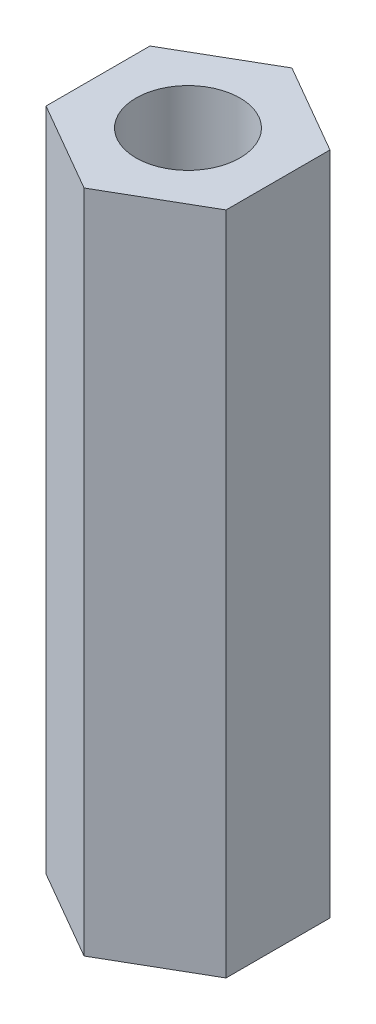
ISO-10303-21;
HEADER;
FILE_DESCRIPTION(('STEP AP214'),'2;1');
FILE_NAME('part.step','',(''),(''),'','','');
FILE_SCHEMA(('AUTOMOTIVE_DESIGN { 1 0 10303 214 1 1 1 1 }'));
ENDSEC;
DATA;
#1=APPLICATION_CONTEXT('core data for automotive mechanical design processes');
#2=APPLICATION_PROTOCOL_DEFINITION('international standard','automotive_design',2000,#1);
#3=PRODUCT_CONTEXT('',#1,'mechanical');
#4=PRODUCT('Part','Part','',(#3));
#5=PRODUCT_RELATED_PRODUCT_CATEGORY('part','',(#4));
#6=PRODUCT_DEFINITION_FORMATION('','',#4);
#7=PRODUCT_DEFINITION_CONTEXT('part definition',#1,'design');
#8=PRODUCT_DEFINITION('design','',#6,#7);
#9=PRODUCT_DEFINITION_SHAPE('','',#8);
#10=(LENGTH_UNIT() NAMED_UNIT(*) SI_UNIT(.MILLI.,.METRE.));
#11=(NAMED_UNIT(*) PLANE_ANGLE_UNIT() SI_UNIT($,.RADIAN.));
#12=(NAMED_UNIT(*) SI_UNIT($,.STERADIAN.) SOLID_ANGLE_UNIT());
#13=UNCERTAINTY_MEASURE_WITH_UNIT(LENGTH_MEASURE(1.E-05),#10,'distance_accuracy_value','');
#14=(GEOMETRIC_REPRESENTATION_CONTEXT(3) GLOBAL_UNCERTAINTY_ASSIGNED_CONTEXT((#13)) GLOBAL_UNIT_ASSIGNED_CONTEXT((#10,
#11,#12)) REPRESENTATION_CONTEXT('',''));
#15=CARTESIAN_POINT('',(0.,0.,0.));
#16=DIRECTION('',(0.,0.,1.));
#17=DIRECTION('',(1.,0.,0.));
#18=AXIS2_PLACEMENT_3D('',#15,#16,#17);
#19=CARTESIAN_POINT('',(0.,32.,-5.));
#20=DIRECTION('',(0.,1.,0.));
#21=DIRECTION('',(0.,0.,1.));
#22=AXIS2_PLACEMENT_3D('',#19,#20,#21);
#23=PLANE('',#22);
#24=DIRECTION('',(-0.866025403784439,0.,-0.5));
#25=VECTOR('',#24,1.);
#26=CARTESIAN_POINT('',(4.33012701892219,32.,-2.5));
#27=LINE('',#26,#25);
#28=CARTESIAN_POINT('',(4.33012701892219,32.,-2.5));
#29=VERTEX_POINT('',#28);
#30=CARTESIAN_POINT('',(0.,32.,-5.));
#31=VERTEX_POINT('',#30);
#32=EDGE_CURVE('E127',#29,#31,#27,.T.);
#33=ORIENTED_EDGE('',*,*,#32,.T.);
#34=DIRECTION('',(-0.866025403784439,0.,0.5));
#35=VECTOR('',#34,1.);
#36=CARTESIAN_POINT('',(0.,32.,-5.));
#37=LINE('',#36,#35);
#38=CARTESIAN_POINT('',(-4.33012701892219,32.,-2.5));
#39=VERTEX_POINT('',#38);
#40=EDGE_CURVE('E85',#31,#39,#37,.T.);
#41=ORIENTED_EDGE('',*,*,#40,.T.);
#42=DIRECTION('',(0.,0.,1.));
#43=VECTOR('',#42,1.);
#44=CARTESIAN_POINT('',(-4.33012701892219,32.,-2.5));
#45=LINE('',#44,#43);
#46=CARTESIAN_POINT('',(-4.33012701892219,32.,2.5));
#47=VERTEX_POINT('',#46);
#48=EDGE_CURVE('E98',#39,#47,#45,.T.);
#49=ORIENTED_EDGE('',*,*,#48,.T.);
#50=DIRECTION('',(0.866025403784439,0.,0.5));
#51=VECTOR('',#50,1.);
#52=CARTESIAN_POINT('',(-4.33012701892219,32.,2.5));
#53=LINE('',#52,#51);
#54=CARTESIAN_POINT('',(0.,32.,5.));
#55=VERTEX_POINT('',#54);
#56=EDGE_CURVE('E92',#47,#55,#53,.T.);
#57=ORIENTED_EDGE('',*,*,#56,.T.);
#58=DIRECTION('',(0.866025403784439,0.,-0.5));
#59=VECTOR('',#58,1.);
#60=CARTESIAN_POINT('',(0.,32.,5.));
#61=LINE('',#60,#59);
#62=CARTESIAN_POINT('',(4.33012701892219,32.,2.5));
#63=VERTEX_POINT('',#62);
#64=EDGE_CURVE('E96',#55,#63,#61,.T.);
#65=ORIENTED_EDGE('',*,*,#64,.T.);
#66=DIRECTION('',(0.,0.,-1.));
#67=VECTOR('',#66,1.);
#68=CARTESIAN_POINT('',(4.33012701892219,32.,2.5));
#69=LINE('',#68,#67);
#70=EDGE_CURVE('E48',#63,#29,#69,.T.);
#71=ORIENTED_EDGE('',*,*,#70,.T.);
#72=EDGE_LOOP('',(#33,#41,#49,#57,#65,#71));
#73=FACE_BOUND('',#72,.T.);
#74=CARTESIAN_POINT('',(0.,32.,0.));
#75=DIRECTION('',(0.,1.,0.));
#76=DIRECTION('',(0.,0.,1.));
#77=AXIS2_PLACEMENT_3D('',#74,#75,#76);
#78=CIRCLE('',#77,2.5);
#79=CARTESIAN_POINT('',(0.,32.,2.5));
#80=VERTEX_POINT('',#79);
#81=EDGE_CURVE('E120',#80,#80,#78,.T.);
#82=ORIENTED_EDGE('',*,*,#81,.F.);
#83=EDGE_LOOP('',(#82));
#84=FACE_BOUND('',#83,.T.);
#85=ADVANCED_FACE('F31',(#73,#84),#23,.T.);
#86=CARTESIAN_POINT('',(0.,0.,-5.));
#87=DIRECTION('',(0.,1.,0.));
#88=DIRECTION('',(0.,0.,1.));
#89=AXIS2_PLACEMENT_3D('',#86,#87,#88);
#90=PLANE('',#89);
#91=DIRECTION('',(-0.866025403784439,0.,-0.5));
#92=VECTOR('',#91,1.);
#93=CARTESIAN_POINT('',(4.33012701892219,0.,-2.5));
#94=LINE('',#93,#92);
#95=CARTESIAN_POINT('',(4.33012701892219,0.,-2.5));
#96=VERTEX_POINT('',#95);
#97=CARTESIAN_POINT('',(0.,0.,-5.));
#98=VERTEX_POINT('',#97);
#99=EDGE_CURVE('E116',#96,#98,#94,.T.);
#100=ORIENTED_EDGE('',*,*,#99,.F.);
#101=DIRECTION('',(0.,0.,-1.));
#102=VECTOR('',#101,1.);
#103=CARTESIAN_POINT('',(4.33012701892219,0.,2.5));
#104=LINE('',#103,#102);
#105=CARTESIAN_POINT('',(4.33012701892219,0.,2.5));
#106=VERTEX_POINT('',#105);
#107=EDGE_CURVE('E77',#106,#96,#104,.T.);
#108=ORIENTED_EDGE('',*,*,#107,.F.);
#109=DIRECTION('',(0.866025403784439,0.,-0.5));
#110=VECTOR('',#109,1.);
#111=CARTESIAN_POINT('',(0.,0.,5.));
#112=LINE('',#111,#110);
#113=CARTESIAN_POINT('',(0.,0.,5.));
#114=VERTEX_POINT('',#113);
#115=EDGE_CURVE('E71',#114,#106,#112,.T.);
#116=ORIENTED_EDGE('',*,*,#115,.F.);
#117=DIRECTION('',(0.866025403784439,0.,0.5));
#118=VECTOR('',#117,1.);
#119=CARTESIAN_POINT('',(-4.33012701892219,0.,2.5));
#120=LINE('',#119,#118);
#121=CARTESIAN_POINT('',(-4.33012701892219,0.,2.5));
#122=VERTEX_POINT('',#121);
#123=EDGE_CURVE('E106',#122,#114,#120,.T.);
#124=ORIENTED_EDGE('',*,*,#123,.F.);
#125=DIRECTION('',(0.,0.,1.));
#126=VECTOR('',#125,1.);
#127=CARTESIAN_POINT('',(-4.33012701892219,0.,-2.5));
#128=LINE('',#127,#126);
#129=CARTESIAN_POINT('',(-4.33012701892219,0.,-2.5));
#130=VERTEX_POINT('',#129);
#131=EDGE_CURVE('E122',#130,#122,#128,.T.);
#132=ORIENTED_EDGE('',*,*,#131,.F.);
#133=DIRECTION('',(-0.866025403784439,0.,0.5));
#134=VECTOR('',#133,1.);
#135=CARTESIAN_POINT('',(0.,0.,-5.));
#136=LINE('',#135,#134);
#137=EDGE_CURVE('E119',#98,#130,#136,.T.);
#138=ORIENTED_EDGE('',*,*,#137,.F.);
#139=EDGE_LOOP('',(#100,#108,#116,#124,#132,#138));
#140=FACE_BOUND('',#139,.T.);
#141=CARTESIAN_POINT('',(0.,0.,0.));
#142=DIRECTION('',(0.,1.,0.));
#143=DIRECTION('',(0.,0.,1.));
#144=AXIS2_PLACEMENT_3D('',#141,#142,#143);
#145=CIRCLE('',#144,2.5);
#146=CARTESIAN_POINT('',(0.,0.,2.5));
#147=VERTEX_POINT('',#146);
#148=EDGE_CURVE('E220',#147,#147,#145,.T.);
#149=ORIENTED_EDGE('',*,*,#148,.T.);
#150=EDGE_LOOP('',(#149));
#151=FACE_BOUND('',#150,.T.);
#152=ADVANCED_FACE('F136',(#140,#151),#90,.F.);
#153=CARTESIAN_POINT('',(4.33012701892219,32.,-2.5));
#154=DIRECTION('',(-0.5,0.,0.866025403784439));
#155=DIRECTION('',(0.866025403784439,0.,0.5));
#156=AXIS2_PLACEMENT_3D('',#153,#154,#155);
#157=PLANE('',#156);
#158=ORIENTED_EDGE('',*,*,#99,.T.);
#159=DIRECTION('',(0.,-1.,0.));
#160=VECTOR('',#159,1.);
#161=CARTESIAN_POINT('',(0.,32.,-5.));
#162=LINE('',#161,#160);
#163=EDGE_CURVE('E11',#31,#98,#162,.T.);
#164=ORIENTED_EDGE('',*,*,#163,.F.);
#165=ORIENTED_EDGE('',*,*,#32,.F.);
#166=DIRECTION('',(0.,-1.,0.));
#167=VECTOR('',#166,1.);
#168=CARTESIAN_POINT('',(4.33012701892219,32.,-2.5));
#169=LINE('',#168,#167);
#170=EDGE_CURVE('E112',#29,#96,#169,.T.);
#171=ORIENTED_EDGE('',*,*,#170,.T.);
#172=EDGE_LOOP('',(#158,#164,#165,#171));
#173=FACE_BOUND('',#172,.T.);
#174=ADVANCED_FACE('F33',(#173),#157,.F.);
#175=CARTESIAN_POINT('',(0.,32.,-5.));
#176=DIRECTION('',(0.5,0.,0.866025403784439));
#177=DIRECTION('',(0.866025403784439,0.,-0.5));
#178=AXIS2_PLACEMENT_3D('',#175,#176,#177);
#179=PLANE('',#178);
#180=ORIENTED_EDGE('',*,*,#137,.T.);
#181=DIRECTION('',(0.,-1.,0.));
#182=VECTOR('',#181,1.);
#183=CARTESIAN_POINT('',(-4.33012701892219,32.,-2.5));
#184=LINE('',#183,#182);
#185=EDGE_CURVE('E40',#39,#130,#184,.T.);
#186=ORIENTED_EDGE('',*,*,#185,.F.);
#187=ORIENTED_EDGE('',*,*,#40,.F.);
#188=ORIENTED_EDGE('',*,*,#163,.T.);
#189=EDGE_LOOP('',(#180,#186,#187,#188));
#190=FACE_BOUND('',#189,.T.);
#191=ADVANCED_FACE('F161',(#190),#179,.F.);
#192=CARTESIAN_POINT('',(-4.33012701892219,32.,-2.5));
#193=DIRECTION('',(1.,0.,0.));
#194=DIRECTION('',(0.,0.,-1.));
#195=AXIS2_PLACEMENT_3D('',#192,#193,#194);
#196=PLANE('',#195);
#197=ORIENTED_EDGE('',*,*,#131,.T.);
#198=DIRECTION('',(0.,-1.,0.));
#199=VECTOR('',#198,1.);
#200=CARTESIAN_POINT('',(-4.33012701892219,32.,2.5));
#201=LINE('',#200,#199);
#202=EDGE_CURVE('E107',#47,#122,#201,.T.);
#203=ORIENTED_EDGE('',*,*,#202,.F.);
#204=ORIENTED_EDGE('',*,*,#48,.F.);
#205=ORIENTED_EDGE('',*,*,#185,.T.);
#206=EDGE_LOOP('',(#197,#203,#204,#205));
#207=FACE_BOUND('',#206,.T.);
#208=ADVANCED_FACE('F133',(#207),#196,.F.);
#209=CARTESIAN_POINT('',(-4.33012701892219,32.,2.5));
#210=DIRECTION('',(0.5,0.,-0.866025403784439));
#211=DIRECTION('',(-0.866025403784439,0.,-0.5));
#212=AXIS2_PLACEMENT_3D('',#209,#210,#211);
#213=PLANE('',#212);
#214=ORIENTED_EDGE('',*,*,#123,.T.);
#215=DIRECTION('',(0.,-1.,0.));
#216=VECTOR('',#215,1.);
#217=CARTESIAN_POINT('',(0.,32.,5.));
#218=LINE('',#217,#216);
#219=EDGE_CURVE('E103',#55,#114,#218,.T.);
#220=ORIENTED_EDGE('',*,*,#219,.F.);
#221=ORIENTED_EDGE('',*,*,#56,.F.);
#222=ORIENTED_EDGE('',*,*,#202,.T.);
#223=EDGE_LOOP('',(#214,#220,#221,#222));
#224=FACE_BOUND('',#223,.T.);
#225=ADVANCED_FACE('F104',(#224),#213,.F.);
#226=CARTESIAN_POINT('',(0.,32.,5.));
#227=DIRECTION('',(-0.5,0.,-0.866025403784439));
#228=DIRECTION('',(-0.866025403784439,0.,0.5));
#229=AXIS2_PLACEMENT_3D('',#226,#227,#228);
#230=PLANE('',#229);
#231=ORIENTED_EDGE('',*,*,#115,.T.);
#232=DIRECTION('',(0.,-1.,0.));
#233=VECTOR('',#232,1.);
#234=CARTESIAN_POINT('',(4.33012701892219,32.,2.5));
#235=LINE('',#234,#233);
#236=EDGE_CURVE('E108',#63,#106,#235,.T.);
#237=ORIENTED_EDGE('',*,*,#236,.F.);
#238=ORIENTED_EDGE('',*,*,#64,.F.);
#239=ORIENTED_EDGE('',*,*,#219,.T.);
#240=EDGE_LOOP('',(#231,#237,#238,#239));
#241=FACE_BOUND('',#240,.T.);
#242=ADVANCED_FACE('F110',(#241),#230,.F.);
#243=CARTESIAN_POINT('',(4.33012701892219,32.,2.5));
#244=DIRECTION('',(-1.,0.,0.));
#245=DIRECTION('',(0.,0.,1.));
#246=AXIS2_PLACEMENT_3D('',#243,#244,#245);
#247=PLANE('',#246);
#248=ORIENTED_EDGE('',*,*,#107,.T.);
#249=ORIENTED_EDGE('',*,*,#170,.F.);
#250=ORIENTED_EDGE('',*,*,#70,.F.);
#251=ORIENTED_EDGE('',*,*,#236,.T.);
#252=EDGE_LOOP('',(#248,#249,#250,#251));
#253=FACE_BOUND('',#252,.T.);
#254=ADVANCED_FACE('F141',(#253),#247,.F.);
#255=CARTESIAN_POINT('',(0.,32.,0.));
#256=DIRECTION('',(0.,-1.,0.));
#257=DIRECTION('',(0.,0.,-1.));
#258=AXIS2_PLACEMENT_3D('',#255,#256,#257);
#259=CYLINDRICAL_SURFACE('',#258,2.5);
#260=ORIENTED_EDGE('',*,*,#81,.T.);
#261=EDGE_LOOP('',(#260));
#262=FACE_BOUND('',#261,.T.);
#263=ORIENTED_EDGE('',*,*,#148,.F.);
#264=EDGE_LOOP('',(#263));
#265=FACE_BOUND('',#264,.T.);
#266=ADVANCED_FACE('F143',(#262,#265),#259,.F.);
#267=CLOSED_SHELL('',(#85,#152,#174,#191,#208,#225,#242,#254,#266));
#268=MANIFOLD_SOLID_BREP('B2',#267);
#269=ADVANCED_BREP_SHAPE_REPRESENTATION('',(#18,#268),#14);
#270=SHAPE_DEFINITION_REPRESENTATION(#9,#269);
ENDSEC;
END-ISO-10303-21;
